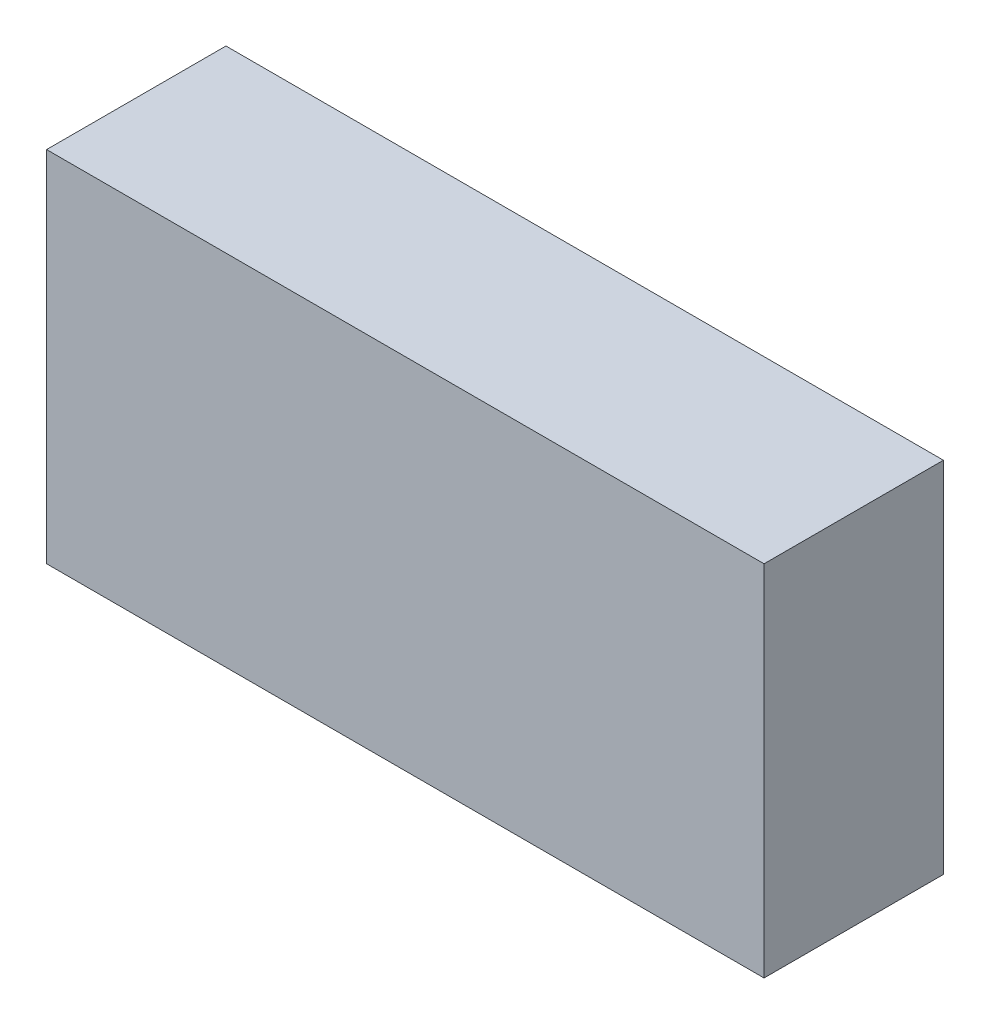
ISO-10303-21;
HEADER;
FILE_DESCRIPTION(('STEP AP214'),'2;1');
FILE_NAME('part.step','',(''),(''),'','','');
FILE_SCHEMA(('AUTOMOTIVE_DESIGN { 1 0 10303 214 1 1 1 1 }'));
ENDSEC;
DATA;
#1=APPLICATION_CONTEXT('core data for automotive mechanical design processes');
#2=APPLICATION_PROTOCOL_DEFINITION('international standard','automotive_design',2000,#1);
#3=PRODUCT_CONTEXT('',#1,'mechanical');
#4=PRODUCT('Part','Part','',(#3));
#5=PRODUCT_RELATED_PRODUCT_CATEGORY('part','',(#4));
#6=PRODUCT_DEFINITION_FORMATION('','',#4);
#7=PRODUCT_DEFINITION_CONTEXT('part definition',#1,'design');
#8=PRODUCT_DEFINITION('design','',#6,#7);
#9=PRODUCT_DEFINITION_SHAPE('','',#8);
#10=(LENGTH_UNIT() NAMED_UNIT(*) SI_UNIT(.MILLI.,.METRE.));
#11=(NAMED_UNIT(*) PLANE_ANGLE_UNIT() SI_UNIT($,.RADIAN.));
#12=(NAMED_UNIT(*) SI_UNIT($,.STERADIAN.) SOLID_ANGLE_UNIT());
#13=UNCERTAINTY_MEASURE_WITH_UNIT(LENGTH_MEASURE(1.E-05),#10,'distance_accuracy_value','');
#14=(GEOMETRIC_REPRESENTATION_CONTEXT(3) GLOBAL_UNCERTAINTY_ASSIGNED_CONTEXT((#13)) GLOBAL_UNIT_ASSIGNED_CONTEXT((#10,
#11,#12)) REPRESENTATION_CONTEXT('',''));
#15=CARTESIAN_POINT('',(0.,0.,0.));
#16=DIRECTION('',(0.,0.,1.));
#17=DIRECTION('',(1.,0.,0.));
#18=AXIS2_PLACEMENT_3D('',#15,#16,#17);
#19=CARTESIAN_POINT('',(-42.1509825136641,50.8,-67.2187474446979));
#20=DIRECTION('',(1.,0.,0.));
#21=DIRECTION('',(0.,0.,-1.));
#22=AXIS2_PLACEMENT_3D('',#19,#20,#21);
#23=PLANE('',#22);
#24=DIRECTION('',(0.,0.,1.));
#25=VECTOR('',#24,1.);
#26=CARTESIAN_POINT('',(-42.1509825136641,0.,-67.2187474446979));
#27=LINE('',#26,#25);
#28=CARTESIAN_POINT('',(-42.1509825136641,0.,-67.2187474446979));
#29=VERTEX_POINT('',#28);
#30=CARTESIAN_POINT('',(-42.1509825136641,0.,-41.8187474446979));
#31=VERTEX_POINT('',#30);
#32=EDGE_CURVE('E96',#29,#31,#27,.T.);
#33=ORIENTED_EDGE('',*,*,#32,.T.);
#34=DIRECTION('',(0.,-1.,0.));
#35=VECTOR('',#34,1.);
#36=CARTESIAN_POINT('',(-42.1509825136641,50.8,-41.8187474446979));
#37=LINE('',#36,#35);
#38=CARTESIAN_POINT('',(-42.1509825136641,50.8,-41.8187474446979));
#39=VERTEX_POINT('',#38);
#40=EDGE_CURVE('E11',#39,#31,#37,.T.);
#41=ORIENTED_EDGE('',*,*,#40,.F.);
#42=DIRECTION('',(0.,0.,1.));
#43=VECTOR('',#42,1.);
#44=CARTESIAN_POINT('',(-42.1509825136641,50.8,-67.2187474446979));
#45=LINE('',#44,#43);
#46=CARTESIAN_POINT('',(-42.1509825136641,50.8,-67.2187474446979));
#47=VERTEX_POINT('',#46);
#48=EDGE_CURVE('E84',#47,#39,#45,.T.);
#49=ORIENTED_EDGE('',*,*,#48,.F.);
#50=DIRECTION('',(0.,-1.,0.));
#51=VECTOR('',#50,1.);
#52=CARTESIAN_POINT('',(-42.1509825136641,50.8,-67.2187474446979));
#53=LINE('',#52,#51);
#54=EDGE_CURVE('E92',#47,#29,#53,.T.);
#55=ORIENTED_EDGE('',*,*,#54,.T.);
#56=EDGE_LOOP('',(#33,#41,#49,#55));
#57=FACE_BOUND('',#56,.T.);
#58=ADVANCED_FACE('F33',(#57),#23,.F.);
#59=CARTESIAN_POINT('',(-42.1509825136641,50.8,-41.8187474446979));
#60=DIRECTION('',(0.,0.,-1.));
#61=DIRECTION('',(-1.,0.,0.));
#62=AXIS2_PLACEMENT_3D('',#59,#60,#61);
#63=PLANE('',#62);
#64=DIRECTION('',(1.,0.,0.));
#65=VECTOR('',#64,1.);
#66=CARTESIAN_POINT('',(-42.1509825136641,0.,-41.8187474446979));
#67=LINE('',#66,#65);
#68=CARTESIAN_POINT('',(59.4490174863359,0.,-41.8187474446979));
#69=VERTEX_POINT('',#68);
#70=EDGE_CURVE('E88',#31,#69,#67,.T.);
#71=ORIENTED_EDGE('',*,*,#70,.T.);
#72=DIRECTION('',(0.,-1.,0.));
#73=VECTOR('',#72,1.);
#74=CARTESIAN_POINT('',(59.4490174863359,50.8,-41.8187474446979));
#75=LINE('',#74,#73);
#76=CARTESIAN_POINT('',(59.4490174863359,50.8,-41.8187474446979));
#77=VERTEX_POINT('',#76);
#78=EDGE_CURVE('E41',#77,#69,#75,.T.);
#79=ORIENTED_EDGE('',*,*,#78,.F.);
#80=DIRECTION('',(1.,0.,0.));
#81=VECTOR('',#80,1.);
#82=CARTESIAN_POINT('',(-42.1509825136641,50.8,-41.8187474446979));
#83=LINE('',#82,#81);
#84=EDGE_CURVE('E79',#39,#77,#83,.T.);
#85=ORIENTED_EDGE('',*,*,#84,.F.);
#86=ORIENTED_EDGE('',*,*,#40,.T.);
#87=EDGE_LOOP('',(#71,#79,#85,#86));
#88=FACE_BOUND('',#87,.T.);
#89=ADVANCED_FACE('F87',(#88),#63,.F.);
#90=CARTESIAN_POINT('',(59.4490174863359,50.8,-67.2187474446979));
#91=DIRECTION('',(-1.,0.,0.));
#92=DIRECTION('',(0.,0.,1.));
#93=AXIS2_PLACEMENT_3D('',#90,#91,#92);
#94=PLANE('',#93);
#95=DIRECTION('',(0.,0.,-1.));
#96=VECTOR('',#95,1.);
#97=CARTESIAN_POINT('',(59.4490174863359,0.,-67.2187474446979));
#98=LINE('',#97,#96);
#99=CARTESIAN_POINT('',(59.4490174863359,0.,-67.2187474446979));
#100=VERTEX_POINT('',#99);
#101=EDGE_CURVE('E66',#69,#100,#98,.T.);
#102=ORIENTED_EDGE('',*,*,#101,.T.);
#103=DIRECTION('',(0.,-1.,0.));
#104=VECTOR('',#103,1.);
#105=CARTESIAN_POINT('',(59.4490174863359,50.8,-67.2187474446979));
#106=LINE('',#105,#104);
#107=CARTESIAN_POINT('',(59.4490174863359,50.8,-67.2187474446979));
#108=VERTEX_POINT('',#107);
#109=EDGE_CURVE('E89',#108,#100,#106,.T.);
#110=ORIENTED_EDGE('',*,*,#109,.F.);
#111=DIRECTION('',(0.,0.,-1.));
#112=VECTOR('',#111,1.);
#113=CARTESIAN_POINT('',(59.4490174863359,50.8,-67.2187474446979));
#114=LINE('',#113,#112);
#115=EDGE_CURVE('E82',#77,#108,#114,.T.);
#116=ORIENTED_EDGE('',*,*,#115,.F.);
#117=ORIENTED_EDGE('',*,*,#78,.T.);
#118=EDGE_LOOP('',(#102,#110,#116,#117));
#119=FACE_BOUND('',#118,.T.);
#120=ADVANCED_FACE('F90',(#119),#94,.F.);
#121=CARTESIAN_POINT('',(-42.1509825136641,50.8,-67.2187474446979));
#122=DIRECTION('',(0.,0.,1.));
#123=DIRECTION('',(1.,0.,0.));
#124=AXIS2_PLACEMENT_3D('',#121,#122,#123);
#125=PLANE('',#124);
#126=DIRECTION('',(-1.,0.,0.));
#127=VECTOR('',#126,1.);
#128=CARTESIAN_POINT('',(-42.1509825136641,0.,-67.2187474446979));
#129=LINE('',#128,#127);
#130=EDGE_CURVE('E72',#100,#29,#129,.T.);
#131=ORIENTED_EDGE('',*,*,#130,.T.);
#132=ORIENTED_EDGE('',*,*,#54,.F.);
#133=DIRECTION('',(-1.,0.,0.));
#134=VECTOR('',#133,1.);
#135=CARTESIAN_POINT('',(-42.1509825136641,50.8,-67.2187474446979));
#136=LINE('',#135,#134);
#137=EDGE_CURVE('E49',#108,#47,#136,.T.);
#138=ORIENTED_EDGE('',*,*,#137,.F.);
#139=ORIENTED_EDGE('',*,*,#109,.T.);
#140=EDGE_LOOP('',(#131,#132,#138,#139));
#141=FACE_BOUND('',#140,.T.);
#142=ADVANCED_FACE('F103',(#141),#125,.F.);
#143=CARTESIAN_POINT('',(-42.1509825136641,50.8,-41.8187474446979));
#144=DIRECTION('',(0.,1.,0.));
#145=DIRECTION('',(0.,0.,1.));
#146=AXIS2_PLACEMENT_3D('',#143,#144,#145);
#147=PLANE('',#146);
#148=ORIENTED_EDGE('',*,*,#48,.T.);
#149=ORIENTED_EDGE('',*,*,#84,.T.);
#150=ORIENTED_EDGE('',*,*,#115,.T.);
#151=ORIENTED_EDGE('',*,*,#137,.T.);
#152=EDGE_LOOP('',(#148,#149,#150,#151));
#153=FACE_BOUND('',#152,.T.);
#154=ADVANCED_FACE('F80',(#153),#147,.T.);
#155=CARTESIAN_POINT('',(-42.1509825136641,0.,-41.8187474446979));
#156=DIRECTION('',(0.,1.,0.));
#157=DIRECTION('',(0.,0.,1.));
#158=AXIS2_PLACEMENT_3D('',#155,#156,#157);
#159=PLANE('',#158);
#160=ORIENTED_EDGE('',*,*,#32,.F.);
#161=ORIENTED_EDGE('',*,*,#130,.F.);
#162=ORIENTED_EDGE('',*,*,#101,.F.);
#163=ORIENTED_EDGE('',*,*,#70,.F.);
#164=EDGE_LOOP('',(#160,#161,#162,#163));
#165=FACE_BOUND('',#164,.T.);
#166=ADVANCED_FACE('F106',(#165),#159,.F.);
#167=CLOSED_SHELL('',(#58,#89,#120,#142,#154,#166));
#168=MANIFOLD_SOLID_BREP('B2',#167);
#169=ADVANCED_BREP_SHAPE_REPRESENTATION('',(#18,#168),#14);
#170=SHAPE_DEFINITION_REPRESENTATION(#9,#169);
ENDSEC;
END-ISO-10303-21;
